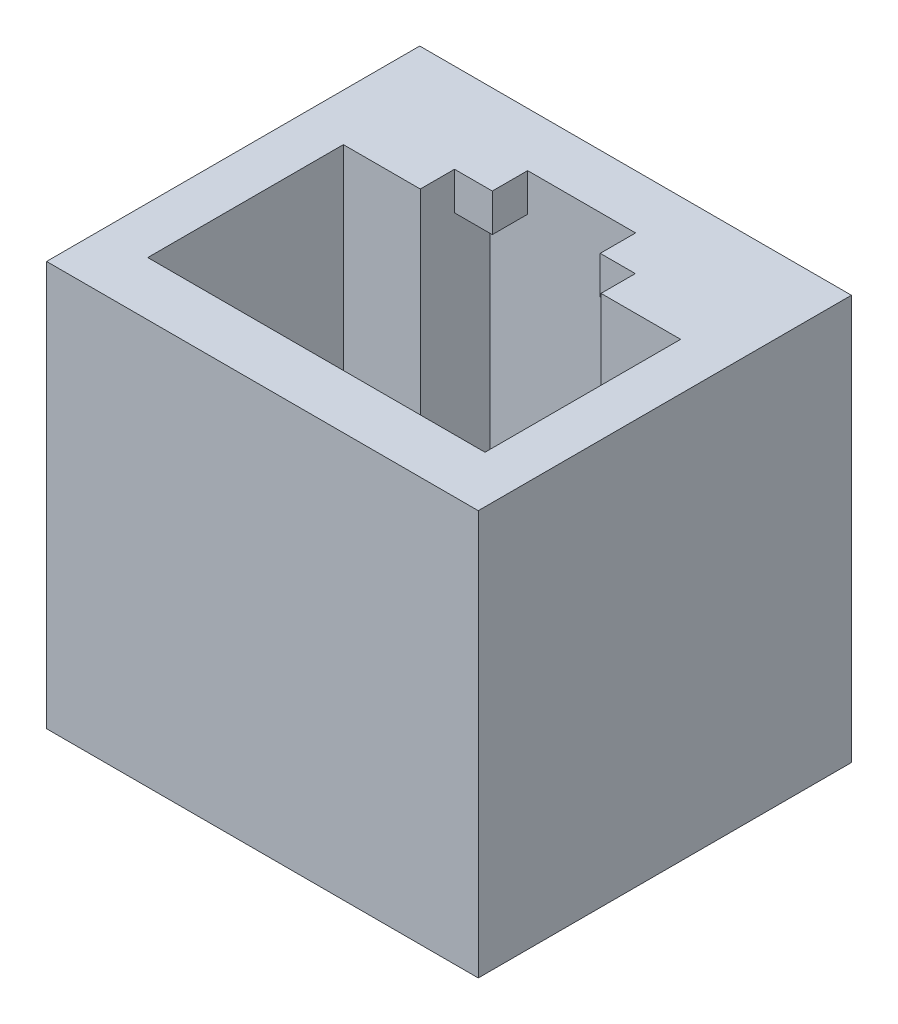
ISO-10303-21;
HEADER;
FILE_DESCRIPTION(('STEP AP214'),'2;1');
FILE_NAME('part.step','',(''),(''),'','','');
FILE_SCHEMA(('AUTOMOTIVE_DESIGN { 1 0 10303 214 1 1 1 1 }'));
ENDSEC;
DATA;
#1=APPLICATION_CONTEXT('core data for automotive mechanical design processes');
#2=APPLICATION_PROTOCOL_DEFINITION('international standard','automotive_design',2000,#1);
#3=PRODUCT_CONTEXT('',#1,'mechanical');
#4=PRODUCT('Part','Part','',(#3));
#5=PRODUCT_RELATED_PRODUCT_CATEGORY('part','',(#4));
#6=PRODUCT_DEFINITION_FORMATION('','',#4);
#7=PRODUCT_DEFINITION_CONTEXT('part definition',#1,'design');
#8=PRODUCT_DEFINITION('design','',#6,#7);
#9=PRODUCT_DEFINITION_SHAPE('','',#8);
#10=(LENGTH_UNIT() NAMED_UNIT(*) SI_UNIT(.MILLI.,.METRE.));
#11=(NAMED_UNIT(*) PLANE_ANGLE_UNIT() SI_UNIT($,.RADIAN.));
#12=(NAMED_UNIT(*) SI_UNIT($,.STERADIAN.) SOLID_ANGLE_UNIT());
#13=UNCERTAINTY_MEASURE_WITH_UNIT(LENGTH_MEASURE(1.E-05),#10,'distance_accuracy_value','');
#14=(GEOMETRIC_REPRESENTATION_CONTEXT(3) GLOBAL_UNCERTAINTY_ASSIGNED_CONTEXT((#13)) GLOBAL_UNIT_ASSIGNED_CONTEXT((#10,
#11,#12)) REPRESENTATION_CONTEXT('',''));
#15=CARTESIAN_POINT('',(0.,0.,0.));
#16=DIRECTION('',(0.,0.,1.));
#17=DIRECTION('',(1.,0.,0.));
#18=AXIS2_PLACEMENT_3D('',#15,#16,#17);
#19=CARTESIAN_POINT('',(-1.75,25.,-11.83));
#20=DIRECTION('',(1.,0.,0.));
#21=DIRECTION('',(0.,0.,-1.));
#22=AXIS2_PLACEMENT_3D('',#19,#20,#21);
#23=PLANE('',#22);
#24=DIRECTION('',(0.,0.,-1.));
#25=VECTOR('',#24,1.);
#26=CARTESIAN_POINT('',(-1.75,10.,2.));
#27=LINE('',#26,#25);
#28=CARTESIAN_POINT('',(-1.75,10.,2.));
#29=VERTEX_POINT('',#28);
#30=CARTESIAN_POINT('',(-1.75,10.,-11.83));
#31=VERTEX_POINT('',#30);
#32=EDGE_CURVE('E55',#29,#31,#27,.T.);
#33=ORIENTED_EDGE('',*,*,#32,.F.);
#34=DIRECTION('',(0.,-1.,0.));
#35=VECTOR('',#34,1.);
#36=CARTESIAN_POINT('',(-1.75,25.,2.));
#37=LINE('',#36,#35);
#38=CARTESIAN_POINT('',(-1.75,25.,2.));
#39=VERTEX_POINT('',#38);
#40=EDGE_CURVE('E48',#39,#29,#37,.T.);
#41=ORIENTED_EDGE('',*,*,#40,.F.);
#42=DIRECTION('',(0.,0.,1.));
#43=VECTOR('',#42,1.);
#44=CARTESIAN_POINT('',(-1.75,25.,-11.83));
#45=LINE('',#44,#43);
#46=CARTESIAN_POINT('',(-1.75,25.,-11.83));
#47=VERTEX_POINT('',#46);
#48=EDGE_CURVE('E233',#47,#39,#45,.T.);
#49=ORIENTED_EDGE('',*,*,#48,.F.);
#50=DIRECTION('',(0.,-1.,0.));
#51=VECTOR('',#50,1.);
#52=CARTESIAN_POINT('',(-1.75,25.,-11.83));
#53=LINE('',#52,#51);
#54=EDGE_CURVE('E220',#47,#31,#53,.T.);
#55=ORIENTED_EDGE('',*,*,#54,.T.);
#56=EDGE_LOOP('',(#33,#41,#49,#55));
#57=FACE_BOUND('',#56,.T.);
#58=ADVANCED_FACE('F41',(#57),#23,.F.);
#59=CARTESIAN_POINT('',(-1.75,25.,2.));
#60=DIRECTION('',(0.,0.,-1.));
#61=DIRECTION('',(-1.,0.,0.));
#62=AXIS2_PLACEMENT_3D('',#59,#60,#61);
#63=PLANE('',#62);
#64=DIRECTION('',(-1.,0.,0.));
#65=VECTOR('',#64,1.);
#66=CARTESIAN_POINT('',(-1.75,10.,2.));
#67=LINE('',#66,#65);
#68=CARTESIAN_POINT('',(14.25,10.,2.));
#69=VERTEX_POINT('',#68);
#70=EDGE_CURVE('E216',#69,#29,#67,.T.);
#71=ORIENTED_EDGE('',*,*,#70,.F.);
#72=DIRECTION('',(0.,-1.,0.));
#73=VECTOR('',#72,1.);
#74=CARTESIAN_POINT('',(14.25,25.,2.));
#75=LINE('',#74,#73);
#76=CARTESIAN_POINT('',(14.25,25.,2.));
#77=VERTEX_POINT('',#76);
#78=EDGE_CURVE('E215',#77,#69,#75,.T.);
#79=ORIENTED_EDGE('',*,*,#78,.F.);
#80=DIRECTION('',(1.,0.,0.));
#81=VECTOR('',#80,1.);
#82=CARTESIAN_POINT('',(-1.75,25.,2.));
#83=LINE('',#82,#81);
#84=EDGE_CURVE('E229',#39,#77,#83,.T.);
#85=ORIENTED_EDGE('',*,*,#84,.F.);
#86=ORIENTED_EDGE('',*,*,#40,.T.);
#87=EDGE_LOOP('',(#71,#79,#85,#86));
#88=FACE_BOUND('',#87,.T.);
#89=ADVANCED_FACE('F228',(#88),#63,.F.);
#90=CARTESIAN_POINT('',(14.25,25.,-11.83));
#91=DIRECTION('',(-1.,0.,0.));
#92=DIRECTION('',(0.,0.,1.));
#93=AXIS2_PLACEMENT_3D('',#90,#91,#92);
#94=PLANE('',#93);
#95=DIRECTION('',(0.,0.,1.));
#96=VECTOR('',#95,1.);
#97=CARTESIAN_POINT('',(14.25,10.,2.));
#98=LINE('',#97,#96);
#99=CARTESIAN_POINT('',(14.25,10.,-11.83));
#100=VERTEX_POINT('',#99);
#101=EDGE_CURVE('E200',#100,#69,#98,.T.);
#102=ORIENTED_EDGE('',*,*,#101,.F.);
#103=DIRECTION('',(0.,-1.,0.));
#104=VECTOR('',#103,1.);
#105=CARTESIAN_POINT('',(14.25,25.,-11.83));
#106=LINE('',#105,#104);
#107=CARTESIAN_POINT('',(14.25,25.,-11.83));
#108=VERTEX_POINT('',#107);
#109=EDGE_CURVE('E212',#108,#100,#106,.T.);
#110=ORIENTED_EDGE('',*,*,#109,.F.);
#111=DIRECTION('',(0.,0.,-1.));
#112=VECTOR('',#111,1.);
#113=CARTESIAN_POINT('',(14.25,25.,-11.83));
#114=LINE('',#113,#112);
#115=EDGE_CURVE('E393',#77,#108,#114,.T.);
#116=ORIENTED_EDGE('',*,*,#115,.F.);
#117=ORIENTED_EDGE('',*,*,#78,.T.);
#118=EDGE_LOOP('',(#102,#110,#116,#117));
#119=FACE_BOUND('',#118,.T.);
#120=ADVANCED_FACE('F210',(#119),#94,.F.);
#121=CARTESIAN_POINT('',(-1.75,25.,-11.83));
#122=DIRECTION('',(0.,0.,1.));
#123=DIRECTION('',(1.,0.,0.));
#124=AXIS2_PLACEMENT_3D('',#121,#122,#123);
#125=PLANE('',#124);
#126=DIRECTION('',(1.,0.,0.));
#127=VECTOR('',#126,1.);
#128=CARTESIAN_POINT('',(-1.75,10.,-11.83));
#129=LINE('',#128,#127);
#130=EDGE_CURVE('E197',#31,#100,#129,.T.);
#131=ORIENTED_EDGE('',*,*,#130,.F.);
#132=ORIENTED_EDGE('',*,*,#54,.F.);
#133=DIRECTION('',(-1.,0.,0.));
#134=VECTOR('',#133,1.);
#135=CARTESIAN_POINT('',(-1.75,25.,-11.83));
#136=LINE('',#135,#134);
#137=EDGE_CURVE('E219',#108,#47,#136,.T.);
#138=ORIENTED_EDGE('',*,*,#137,.F.);
#139=ORIENTED_EDGE('',*,*,#109,.T.);
#140=EDGE_LOOP('',(#131,#132,#138,#139));
#141=FACE_BOUND('',#140,.T.);
#142=ADVANCED_FACE('F218',(#141),#125,.F.);
#143=CARTESIAN_POINT('',(12.5,25.,0.));
#144=DIRECTION('',(0.,0.,-1.));
#145=DIRECTION('',(-1.,0.,0.));
#146=AXIS2_PLACEMENT_3D('',#143,#144,#145);
#147=PLANE('',#146);
#148=DIRECTION('',(0.,-1.,0.));
#149=VECTOR('',#148,1.);
#150=CARTESIAN_POINT('',(12.5,25.,0.));
#151=LINE('',#150,#149);
#152=CARTESIAN_POINT('',(12.5,25.,0.));
#153=VERTEX_POINT('',#152);
#154=CARTESIAN_POINT('',(12.5,10.,0.));
#155=VERTEX_POINT('',#154);
#156=EDGE_CURVE('E388',#153,#155,#151,.T.);
#157=ORIENTED_EDGE('',*,*,#156,.T.);
#158=DIRECTION('',(-1.,0.,0.));
#159=VECTOR('',#158,1.);
#160=CARTESIAN_POINT('',(12.5,10.,0.));
#161=LINE('',#160,#159);
#162=CARTESIAN_POINT('',(0.,10.,0.));
#163=VERTEX_POINT('',#162);
#164=EDGE_CURVE('E256',#155,#163,#161,.T.);
#165=ORIENTED_EDGE('',*,*,#164,.T.);
#166=DIRECTION('',(0.,-1.,0.));
#167=VECTOR('',#166,1.);
#168=CARTESIAN_POINT('',(0.,25.,0.));
#169=LINE('',#168,#167);
#170=CARTESIAN_POINT('',(0.,25.,0.));
#171=VERTEX_POINT('',#170);
#172=EDGE_CURVE('E355',#171,#163,#169,.T.);
#173=ORIENTED_EDGE('',*,*,#172,.F.);
#174=DIRECTION('',(1.,0.,0.));
#175=VECTOR('',#174,1.);
#176=CARTESIAN_POINT('',(12.5,25.,0.));
#177=LINE('',#176,#175);
#178=EDGE_CURVE('E330',#171,#153,#177,.T.);
#179=ORIENTED_EDGE('',*,*,#178,.T.);
#180=EDGE_LOOP('',(#157,#165,#173,#179));
#181=FACE_BOUND('',#180,.T.);
#182=ADVANCED_FACE('F425',(#181),#147,.T.);
#183=CARTESIAN_POINT('',(12.5,25.,-7.25));
#184=DIRECTION('',(-1.,0.,0.));
#185=DIRECTION('',(0.,0.,1.));
#186=AXIS2_PLACEMENT_3D('',#183,#184,#185);
#187=PLANE('',#186);
#188=DIRECTION('',(0.,-1.,0.));
#189=VECTOR('',#188,1.);
#190=CARTESIAN_POINT('',(12.5,34.9839750654128,-6.1));
#191=LINE('',#190,#189);
#192=CARTESIAN_POINT('',(12.5,16.73,-6.1));
#193=VERTEX_POINT('',#192);
#194=CARTESIAN_POINT('',(12.5,10.,-6.1));
#195=VERTEX_POINT('',#194);
#196=EDGE_CURVE('E317',#193,#195,#191,.T.);
#197=ORIENTED_EDGE('',*,*,#196,.T.);
#198=DIRECTION('',(0.,0.,1.));
#199=VECTOR('',#198,1.);
#200=CARTESIAN_POINT('',(12.5,10.,-7.25));
#201=LINE('',#200,#199);
#202=EDGE_CURVE('E265',#195,#155,#201,.T.);
#203=ORIENTED_EDGE('',*,*,#202,.T.);
#204=ORIENTED_EDGE('',*,*,#156,.F.);
#205=DIRECTION('',(0.,0.,-1.));
#206=VECTOR('',#205,1.);
#207=CARTESIAN_POINT('',(12.5,25.,-7.25));
#208=LINE('',#207,#206);
#209=CARTESIAN_POINT('',(12.5,25.,-7.25));
#210=VERTEX_POINT('',#209);
#211=EDGE_CURVE('E332',#153,#210,#208,.T.);
#212=ORIENTED_EDGE('',*,*,#211,.T.);
#213=DIRECTION('',(0.,-1.,0.));
#214=VECTOR('',#213,1.);
#215=CARTESIAN_POINT('',(12.5,25.,-7.25));
#216=LINE('',#215,#214);
#217=CARTESIAN_POINT('',(12.5,16.73,-7.25));
#218=VERTEX_POINT('',#217);
#219=EDGE_CURVE('E385',#210,#218,#216,.T.);
#220=ORIENTED_EDGE('',*,*,#219,.T.);
#221=DIRECTION('',(0.,0.,1.));
#222=VECTOR('',#221,1.);
#223=CARTESIAN_POINT('',(12.5,16.73,-7.25));
#224=LINE('',#223,#222);
#225=EDGE_CURVE('E315',#218,#193,#224,.T.);
#226=ORIENTED_EDGE('',*,*,#225,.T.);
#227=EDGE_LOOP('',(#197,#203,#204,#212,#220,#226));
#228=FACE_BOUND('',#227,.T.);
#229=ADVANCED_FACE('F409',(#228),#187,.T.);
#230=CARTESIAN_POINT('',(9.55,25.,-7.25));
#231=DIRECTION('',(0.,0.,1.));
#232=DIRECTION('',(1.,0.,0.));
#233=AXIS2_PLACEMENT_3D('',#230,#231,#232);
#234=PLANE('',#233);
#235=DIRECTION('',(0.,-1.,0.));
#236=VECTOR('',#235,1.);
#237=CARTESIAN_POINT('',(9.55,25.,-7.25));
#238=LINE('',#237,#236);
#239=CARTESIAN_POINT('',(9.55,25.,-7.25));
#240=VERTEX_POINT('',#239);
#241=CARTESIAN_POINT('',(9.55,10.,-7.25));
#242=VERTEX_POINT('',#241);
#243=EDGE_CURVE('E382',#240,#242,#238,.T.);
#244=ORIENTED_EDGE('',*,*,#243,.T.);
#245=DIRECTION('',(1.,0.,0.));
#246=VECTOR('',#245,1.);
#247=CARTESIAN_POINT('',(9.55,10.,-7.25));
#248=LINE('',#247,#246);
#249=CARTESIAN_POINT('',(11.5,10.,-7.25));
#250=VERTEX_POINT('',#249);
#251=EDGE_CURVE('E253',#242,#250,#248,.T.);
#252=ORIENTED_EDGE('',*,*,#251,.T.);
#253=DIRECTION('',(0.,-1.,0.));
#254=VECTOR('',#253,1.);
#255=CARTESIAN_POINT('',(11.5,34.9839750654128,-7.25));
#256=LINE('',#255,#254);
#257=CARTESIAN_POINT('',(11.5,16.73,-7.25));
#258=VERTEX_POINT('',#257);
#259=EDGE_CURVE('E320',#258,#250,#256,.T.);
#260=ORIENTED_EDGE('',*,*,#259,.F.);
#261=DIRECTION('',(1.,0.,0.));
#262=VECTOR('',#261,1.);
#263=CARTESIAN_POINT('',(12.5,16.73,-7.25));
#264=LINE('',#263,#262);
#265=EDGE_CURVE('E318',#258,#218,#264,.T.);
#266=ORIENTED_EDGE('',*,*,#265,.T.);
#267=ORIENTED_EDGE('',*,*,#219,.F.);
#268=DIRECTION('',(-1.,0.,0.));
#269=VECTOR('',#268,1.);
#270=CARTESIAN_POINT('',(9.55,25.,-7.25));
#271=LINE('',#270,#269);
#272=EDGE_CURVE('E334',#210,#240,#271,.T.);
#273=ORIENTED_EDGE('',*,*,#272,.T.);
#274=EDGE_LOOP('',(#244,#252,#260,#266,#267,#273));
#275=FACE_BOUND('',#274,.T.);
#276=ADVANCED_FACE('F412',(#275),#234,.T.);
#277=CARTESIAN_POINT('',(9.55,25.,-8.52));
#278=DIRECTION('',(-1.,0.,0.));
#279=DIRECTION('',(0.,0.,1.));
#280=AXIS2_PLACEMENT_3D('',#277,#278,#279);
#281=PLANE('',#280);
#282=DIRECTION('',(0.,-1.,0.));
#283=VECTOR('',#282,1.);
#284=CARTESIAN_POINT('',(9.55,23.6,-9.83));
#285=LINE('',#284,#283);
#286=CARTESIAN_POINT('',(9.55,23.6,-9.83));
#287=VERTEX_POINT('',#286);
#288=CARTESIAN_POINT('',(9.55,10.,-9.83));
#289=VERTEX_POINT('',#288);
#290=EDGE_CURVE('E268',#287,#289,#285,.T.);
#291=ORIENTED_EDGE('',*,*,#290,.T.);
#292=DIRECTION('',(0.,0.,1.));
#293=VECTOR('',#292,1.);
#294=CARTESIAN_POINT('',(9.55,10.,-8.52));
#295=LINE('',#294,#293);
#296=EDGE_CURVE('E250',#289,#242,#295,.T.);
#297=ORIENTED_EDGE('',*,*,#296,.T.);
#298=ORIENTED_EDGE('',*,*,#243,.F.);
#299=DIRECTION('',(0.,0.,-1.));
#300=VECTOR('',#299,1.);
#301=CARTESIAN_POINT('',(9.55,25.,-8.52));
#302=LINE('',#301,#300);
#303=CARTESIAN_POINT('',(9.55,25.,-8.52));
#304=VERTEX_POINT('',#303);
#305=EDGE_CURVE('E336',#240,#304,#302,.T.);
#306=ORIENTED_EDGE('',*,*,#305,.T.);
#307=DIRECTION('',(0.,-1.,0.));
#308=VECTOR('',#307,1.);
#309=CARTESIAN_POINT('',(9.55,25.,-8.52));
#310=LINE('',#309,#308);
#311=CARTESIAN_POINT('',(9.55,23.6,-8.52));
#312=VERTEX_POINT('',#311);
#313=EDGE_CURVE('E379',#304,#312,#310,.T.);
#314=ORIENTED_EDGE('',*,*,#313,.T.);
#315=DIRECTION('',(0.,0.,1.));
#316=VECTOR('',#315,1.);
#317=CARTESIAN_POINT('',(9.55,23.6,-8.52));
#318=LINE('',#317,#316);
#319=EDGE_CURVE('E287',#287,#312,#318,.T.);
#320=ORIENTED_EDGE('',*,*,#319,.F.);
#321=EDGE_LOOP('',(#291,#297,#298,#306,#314,#320));
#322=FACE_BOUND('',#321,.T.);
#323=ADVANCED_FACE('F465',(#322),#281,.T.);
#324=CARTESIAN_POINT('',(4.25,25.,-9.83));
#325=DIRECTION('',(0.,0.,1.));
#326=DIRECTION('',(1.,0.,0.));
#327=AXIS2_PLACEMENT_3D('',#324,#325,#326);
#328=PLANE('',#327);
#329=DIRECTION('',(0.,-1.,0.));
#330=VECTOR('',#329,1.);
#331=CARTESIAN_POINT('',(2.85,23.6,-9.83));
#332=LINE('',#331,#330);
#333=CARTESIAN_POINT('',(2.85,23.6,-9.83));
#334=VERTEX_POINT('',#333);
#335=CARTESIAN_POINT('',(2.85,10.,-9.83));
#336=VERTEX_POINT('',#335);
#337=EDGE_CURVE('E279',#334,#336,#332,.T.);
#338=ORIENTED_EDGE('',*,*,#337,.T.);
#339=DIRECTION('',(1.,0.,0.));
#340=VECTOR('',#339,1.);
#341=CARTESIAN_POINT('',(4.25,10.,-9.83));
#342=LINE('',#341,#340);
#343=EDGE_CURVE('E247',#336,#289,#342,.T.);
#344=ORIENTED_EDGE('',*,*,#343,.T.);
#345=ORIENTED_EDGE('',*,*,#290,.F.);
#346=DIRECTION('',(1.,0.,0.));
#347=VECTOR('',#346,1.);
#348=CARTESIAN_POINT('',(8.25,23.6,-9.83));
#349=LINE('',#348,#347);
#350=CARTESIAN_POINT('',(8.25,23.6,-9.83));
#351=VERTEX_POINT('',#350);
#352=EDGE_CURVE('E289',#351,#287,#349,.T.);
#353=ORIENTED_EDGE('',*,*,#352,.F.);
#354=DIRECTION('',(0.,-1.,0.));
#355=VECTOR('',#354,1.);
#356=CARTESIAN_POINT('',(8.25,25.,-9.83));
#357=LINE('',#356,#355);
#358=CARTESIAN_POINT('',(8.25,25.,-9.83));
#359=VERTEX_POINT('',#358);
#360=EDGE_CURVE('E373',#359,#351,#357,.T.);
#361=ORIENTED_EDGE('',*,*,#360,.F.);
#362=DIRECTION('',(-1.,0.,0.));
#363=VECTOR('',#362,1.);
#364=CARTESIAN_POINT('',(4.25,25.,-9.83));
#365=LINE('',#364,#363);
#366=CARTESIAN_POINT('',(4.25,25.,-9.83));
#367=VERTEX_POINT('',#366);
#368=EDGE_CURVE('E342',#359,#367,#365,.T.);
#369=ORIENTED_EDGE('',*,*,#368,.T.);
#370=DIRECTION('',(0.,-1.,0.));
#371=VECTOR('',#370,1.);
#372=CARTESIAN_POINT('',(4.25,25.,-9.83));
#373=LINE('',#372,#371);
#374=CARTESIAN_POINT('',(4.25,23.6,-9.83));
#375=VERTEX_POINT('',#374);
#376=EDGE_CURVE('E370',#367,#375,#373,.T.);
#377=ORIENTED_EDGE('',*,*,#376,.T.);
#378=DIRECTION('',(1.,0.,0.));
#379=VECTOR('',#378,1.);
#380=CARTESIAN_POINT('',(4.25,23.6,-9.83));
#381=LINE('',#380,#379);
#382=EDGE_CURVE('E277',#334,#375,#381,.T.);
#383=ORIENTED_EDGE('',*,*,#382,.F.);
#384=EDGE_LOOP('',(#338,#344,#345,#353,#361,#369,#377,#383));
#385=FACE_BOUND('',#384,.T.);
#386=ADVANCED_FACE('F452',(#385),#328,.T.);
#387=CARTESIAN_POINT('',(2.85,25.,-7.25));
#388=DIRECTION('',(1.,0.,0.));
#389=DIRECTION('',(0.,0.,-1.));
#390=AXIS2_PLACEMENT_3D('',#387,#388,#389);
#391=PLANE('',#390);
#392=DIRECTION('',(0.,-1.,0.));
#393=VECTOR('',#392,1.);
#394=CARTESIAN_POINT('',(2.85,25.,-7.25));
#395=LINE('',#394,#393);
#396=CARTESIAN_POINT('',(2.85,25.,-7.25));
#397=VERTEX_POINT('',#396);
#398=CARTESIAN_POINT('',(2.85,10.,-7.25));
#399=VERTEX_POINT('',#398);
#400=EDGE_CURVE('E361',#397,#399,#395,.T.);
#401=ORIENTED_EDGE('',*,*,#400,.T.);
#402=DIRECTION('',(0.,0.,-1.));
#403=VECTOR('',#402,1.);
#404=CARTESIAN_POINT('',(2.85,10.,-7.25));
#405=LINE('',#404,#403);
#406=EDGE_CURVE('E244',#399,#336,#405,.T.);
#407=ORIENTED_EDGE('',*,*,#406,.T.);
#408=ORIENTED_EDGE('',*,*,#337,.F.);
#409=DIRECTION('',(0.,0.,-1.));
#410=VECTOR('',#409,1.);
#411=CARTESIAN_POINT('',(2.85,23.6,-8.52));
#412=LINE('',#411,#410);
#413=CARTESIAN_POINT('',(2.85,23.6,-8.52));
#414=VERTEX_POINT('',#413);
#415=EDGE_CURVE('E274',#414,#334,#412,.T.);
#416=ORIENTED_EDGE('',*,*,#415,.F.);
#417=DIRECTION('',(0.,-1.,0.));
#418=VECTOR('',#417,1.);
#419=CARTESIAN_POINT('',(2.85,25.,-8.52));
#420=LINE('',#419,#418);
#421=CARTESIAN_POINT('',(2.85,25.,-8.52));
#422=VERTEX_POINT('',#421);
#423=EDGE_CURVE('E364',#422,#414,#420,.T.);
#424=ORIENTED_EDGE('',*,*,#423,.F.);
#425=DIRECTION('',(0.,0.,1.));
#426=VECTOR('',#425,1.);
#427=CARTESIAN_POINT('',(2.85,25.,-7.25));
#428=LINE('',#427,#426);
#429=EDGE_CURVE('E348',#422,#397,#428,.T.);
#430=ORIENTED_EDGE('',*,*,#429,.T.);
#431=EDGE_LOOP('',(#401,#407,#408,#416,#424,#430));
#432=FACE_BOUND('',#431,.T.);
#433=ADVANCED_FACE('F437',(#432),#391,.T.);
#434=CARTESIAN_POINT('',(0.,25.,-7.25));
#435=DIRECTION('',(0.,0.,1.));
#436=DIRECTION('',(1.,0.,0.));
#437=AXIS2_PLACEMENT_3D('',#434,#435,#436);
#438=PLANE('',#437);
#439=DIRECTION('',(0.,-1.,0.));
#440=VECTOR('',#439,1.);
#441=CARTESIAN_POINT('',(1.,34.9839750654128,-7.25));
#442=LINE('',#441,#440);
#443=CARTESIAN_POINT('',(1.,16.73,-7.25));
#444=VERTEX_POINT('',#443);
#445=CARTESIAN_POINT('',(1.,10.,-7.25));
#446=VERTEX_POINT('',#445);
#447=EDGE_CURVE('E293',#444,#446,#442,.T.);
#448=ORIENTED_EDGE('',*,*,#447,.T.);
#449=DIRECTION('',(1.,0.,0.));
#450=VECTOR('',#449,1.);
#451=CARTESIAN_POINT('',(0.,10.,-7.25));
#452=LINE('',#451,#450);
#453=EDGE_CURVE('E241',#446,#399,#452,.T.);
#454=ORIENTED_EDGE('',*,*,#453,.T.);
#455=ORIENTED_EDGE('',*,*,#400,.F.);
#456=DIRECTION('',(-1.,0.,0.));
#457=VECTOR('',#456,1.);
#458=CARTESIAN_POINT('',(0.,25.,-7.25));
#459=LINE('',#458,#457);
#460=CARTESIAN_POINT('',(0.,25.,-7.25));
#461=VERTEX_POINT('',#460);
#462=EDGE_CURVE('E350',#397,#461,#459,.T.);
#463=ORIENTED_EDGE('',*,*,#462,.T.);
#464=DIRECTION('',(0.,-1.,0.));
#465=VECTOR('',#464,1.);
#466=CARTESIAN_POINT('',(0.,25.,-7.25));
#467=LINE('',#466,#465);
#468=CARTESIAN_POINT('',(0.,16.73,-7.25));
#469=VERTEX_POINT('',#468);
#470=EDGE_CURVE('E358',#461,#469,#467,.T.);
#471=ORIENTED_EDGE('',*,*,#470,.T.);
#472=DIRECTION('',(1.,0.,0.));
#473=VECTOR('',#472,1.);
#474=CARTESIAN_POINT('',(0.,16.73,-7.25));
#475=LINE('',#474,#473);
#476=EDGE_CURVE('E296',#469,#444,#475,.T.);
#477=ORIENTED_EDGE('',*,*,#476,.T.);
#478=EDGE_LOOP('',(#448,#454,#455,#463,#471,#477));
#479=FACE_BOUND('',#478,.T.);
#480=ADVANCED_FACE('F434',(#479),#438,.T.);
#481=CARTESIAN_POINT('',(0.,25.,0.));
#482=DIRECTION('',(1.,0.,0.));
#483=DIRECTION('',(0.,0.,-1.));
#484=AXIS2_PLACEMENT_3D('',#481,#482,#483);
#485=PLANE('',#484);
#486=ORIENTED_EDGE('',*,*,#172,.T.);
#487=DIRECTION('',(0.,0.,-1.));
#488=VECTOR('',#487,1.);
#489=CARTESIAN_POINT('',(0.,10.,0.));
#490=LINE('',#489,#488);
#491=CARTESIAN_POINT('',(0.,10.,-6.1));
#492=VERTEX_POINT('',#491);
#493=EDGE_CURVE('E238',#163,#492,#490,.T.);
#494=ORIENTED_EDGE('',*,*,#493,.T.);
#495=DIRECTION('',(0.,-1.,0.));
#496=VECTOR('',#495,1.);
#497=CARTESIAN_POINT('',(0.,34.9839750654128,-6.1));
#498=LINE('',#497,#496);
#499=CARTESIAN_POINT('',(0.,16.73,-6.1));
#500=VERTEX_POINT('',#499);
#501=EDGE_CURVE('E302',#500,#492,#498,.T.);
#502=ORIENTED_EDGE('',*,*,#501,.F.);
#503=DIRECTION('',(0.,0.,-1.));
#504=VECTOR('',#503,1.);
#505=CARTESIAN_POINT('',(0.,16.73,-7.25));
#506=LINE('',#505,#504);
#507=EDGE_CURVE('E282',#500,#469,#506,.T.);
#508=ORIENTED_EDGE('',*,*,#507,.T.);
#509=ORIENTED_EDGE('',*,*,#470,.F.);
#510=DIRECTION('',(0.,0.,1.));
#511=VECTOR('',#510,1.);
#512=CARTESIAN_POINT('',(0.,25.,0.));
#513=LINE('',#512,#511);
#514=EDGE_CURVE('E353',#461,#171,#513,.T.);
#515=ORIENTED_EDGE('',*,*,#514,.T.);
#516=EDGE_LOOP('',(#486,#494,#502,#508,#509,#515));
#517=FACE_BOUND('',#516,.T.);
#518=ADVANCED_FACE('F428',(#517),#485,.T.);
#519=CARTESIAN_POINT('',(12.5,34.9839750654128,-6.1));
#520=DIRECTION('',(0.,0.,1.));
#521=DIRECTION('',(1.,0.,0.));
#522=AXIS2_PLACEMENT_3D('',#519,#520,#521);
#523=PLANE('',#522);
#524=DIRECTION('',(0.,-1.,0.));
#525=VECTOR('',#524,1.);
#526=CARTESIAN_POINT('',(11.5,34.9839750654128,-6.1));
#527=LINE('',#526,#525);
#528=CARTESIAN_POINT('',(11.5,16.73,-6.1));
#529=VERTEX_POINT('',#528);
#530=CARTESIAN_POINT('',(11.5,10.,-6.1));
#531=VERTEX_POINT('',#530);
#532=EDGE_CURVE('E314',#529,#531,#527,.T.);
#533=ORIENTED_EDGE('',*,*,#532,.T.);
#534=DIRECTION('',(1.,0.,0.));
#535=VECTOR('',#534,1.);
#536=CARTESIAN_POINT('',(12.5,10.,-6.1));
#537=LINE('',#536,#535);
#538=EDGE_CURVE('E262',#531,#195,#537,.T.);
#539=ORIENTED_EDGE('',*,*,#538,.T.);
#540=ORIENTED_EDGE('',*,*,#196,.F.);
#541=DIRECTION('',(-1.,0.,0.));
#542=VECTOR('',#541,1.);
#543=CARTESIAN_POINT('',(12.5,16.73,-6.1));
#544=LINE('',#543,#542);
#545=EDGE_CURVE('E311',#193,#529,#544,.T.);
#546=ORIENTED_EDGE('',*,*,#545,.T.);
#547=EDGE_LOOP('',(#533,#539,#540,#546));
#548=FACE_BOUND('',#547,.T.);
#549=ADVANCED_FACE('F423',(#548),#523,.T.);
#550=CARTESIAN_POINT('',(11.5,34.9839750654128,-7.25));
#551=DIRECTION('',(-1.,0.,0.));
#552=DIRECTION('',(0.,0.,1.));
#553=AXIS2_PLACEMENT_3D('',#550,#551,#552);
#554=PLANE('',#553);
#555=ORIENTED_EDGE('',*,*,#259,.T.);
#556=DIRECTION('',(0.,0.,1.));
#557=VECTOR('',#556,1.);
#558=CARTESIAN_POINT('',(11.5,10.,-7.25));
#559=LINE('',#558,#557);
#560=EDGE_CURVE('E259',#250,#531,#559,.T.);
#561=ORIENTED_EDGE('',*,*,#560,.T.);
#562=ORIENTED_EDGE('',*,*,#532,.F.);
#563=DIRECTION('',(0.,0.,-1.));
#564=VECTOR('',#563,1.);
#565=CARTESIAN_POINT('',(11.5,16.73,-7.25));
#566=LINE('',#565,#564);
#567=EDGE_CURVE('E321',#529,#258,#566,.T.);
#568=ORIENTED_EDGE('',*,*,#567,.T.);
#569=EDGE_LOOP('',(#555,#561,#562,#568));
#570=FACE_BOUND('',#569,.T.);
#571=ADVANCED_FACE('F420',(#570),#554,.T.);
#572=CARTESIAN_POINT('',(1.,34.9839750654128,-7.25));
#573=DIRECTION('',(1.,0.,0.));
#574=DIRECTION('',(0.,0.,-1.));
#575=AXIS2_PLACEMENT_3D('',#572,#573,#574);
#576=PLANE('',#575);
#577=DIRECTION('',(0.,-1.,0.));
#578=VECTOR('',#577,1.);
#579=CARTESIAN_POINT('',(1.,34.9839750654128,-6.1));
#580=LINE('',#579,#578);
#581=CARTESIAN_POINT('',(1.,16.73,-6.1));
#582=VERTEX_POINT('',#581);
#583=CARTESIAN_POINT('',(1.,10.,-6.1));
#584=VERTEX_POINT('',#583);
#585=EDGE_CURVE('E298',#582,#584,#580,.T.);
#586=ORIENTED_EDGE('',*,*,#585,.T.);
#587=DIRECTION('',(0.,0.,-1.));
#588=VECTOR('',#587,1.);
#589=CARTESIAN_POINT('',(1.,10.,-7.25));
#590=LINE('',#589,#588);
#591=EDGE_CURVE('E63',#584,#446,#590,.T.);
#592=ORIENTED_EDGE('',*,*,#591,.T.);
#593=ORIENTED_EDGE('',*,*,#447,.F.);
#594=DIRECTION('',(0.,0.,1.));
#595=VECTOR('',#594,1.);
#596=CARTESIAN_POINT('',(1.,16.73,-7.25));
#597=LINE('',#596,#595);
#598=EDGE_CURVE('E297',#444,#582,#597,.T.);
#599=ORIENTED_EDGE('',*,*,#598,.T.);
#600=EDGE_LOOP('',(#586,#592,#593,#599));
#601=FACE_BOUND('',#600,.T.);
#602=ADVANCED_FACE('F523',(#601),#576,.T.);
#603=CARTESIAN_POINT('',(0.,34.9839750654128,-6.1));
#604=DIRECTION('',(0.,0.,1.));
#605=DIRECTION('',(1.,0.,0.));
#606=AXIS2_PLACEMENT_3D('',#603,#604,#605);
#607=PLANE('',#606);
#608=ORIENTED_EDGE('',*,*,#501,.T.);
#609=DIRECTION('',(1.,0.,0.));
#610=VECTOR('',#609,1.);
#611=CARTESIAN_POINT('',(0.,10.,-6.1));
#612=LINE('',#611,#610);
#613=EDGE_CURVE('E12',#492,#584,#612,.T.);
#614=ORIENTED_EDGE('',*,*,#613,.T.);
#615=ORIENTED_EDGE('',*,*,#585,.F.);
#616=DIRECTION('',(-1.,0.,0.));
#617=VECTOR('',#616,1.);
#618=CARTESIAN_POINT('',(0.,16.73,-6.1));
#619=LINE('',#618,#617);
#620=EDGE_CURVE('E301',#582,#500,#619,.T.);
#621=ORIENTED_EDGE('',*,*,#620,.T.);
#622=EDGE_LOOP('',(#608,#614,#615,#621));
#623=FACE_BOUND('',#622,.T.);
#624=ADVANCED_FACE('F503',(#623),#607,.T.);
#625=CARTESIAN_POINT('',(8.25,25.,-8.52));
#626=DIRECTION('',(0.,0.,1.));
#627=DIRECTION('',(1.,0.,0.));
#628=AXIS2_PLACEMENT_3D('',#625,#626,#627);
#629=PLANE('',#628);
#630=DIRECTION('',(0.,-1.,0.));
#631=VECTOR('',#630,1.);
#632=CARTESIAN_POINT('',(8.25,25.,-8.52));
#633=LINE('',#632,#631);
#634=CARTESIAN_POINT('',(8.25,25.,-8.52));
#635=VERTEX_POINT('',#634);
#636=CARTESIAN_POINT('',(8.25,23.6,-8.52));
#637=VERTEX_POINT('',#636);
#638=EDGE_CURVE('E376',#635,#637,#633,.T.);
#639=ORIENTED_EDGE('',*,*,#638,.T.);
#640=DIRECTION('',(-1.,0.,0.));
#641=VECTOR('',#640,1.);
#642=CARTESIAN_POINT('',(8.25,23.6,-8.52));
#643=LINE('',#642,#641);
#644=EDGE_CURVE('E285',#312,#637,#643,.T.);
#645=ORIENTED_EDGE('',*,*,#644,.F.);
#646=ORIENTED_EDGE('',*,*,#313,.F.);
#647=DIRECTION('',(-1.,0.,0.));
#648=VECTOR('',#647,1.);
#649=CARTESIAN_POINT('',(8.25,25.,-8.52));
#650=LINE('',#649,#648);
#651=EDGE_CURVE('E338',#304,#635,#650,.T.);
#652=ORIENTED_EDGE('',*,*,#651,.T.);
#653=EDGE_LOOP('',(#639,#645,#646,#652));
#654=FACE_BOUND('',#653,.T.);
#655=ADVANCED_FACE('F461',(#654),#629,.T.);
#656=CARTESIAN_POINT('',(8.25,25.,-9.83));
#657=DIRECTION('',(-1.,0.,0.));
#658=DIRECTION('',(0.,0.,1.));
#659=AXIS2_PLACEMENT_3D('',#656,#657,#658);
#660=PLANE('',#659);
#661=ORIENTED_EDGE('',*,*,#360,.T.);
#662=DIRECTION('',(0.,0.,-1.));
#663=VECTOR('',#662,1.);
#664=CARTESIAN_POINT('',(8.25,23.6,-8.52));
#665=LINE('',#664,#663);
#666=EDGE_CURVE('E272',#637,#351,#665,.T.);
#667=ORIENTED_EDGE('',*,*,#666,.F.);
#668=ORIENTED_EDGE('',*,*,#638,.F.);
#669=DIRECTION('',(0.,0.,-1.));
#670=VECTOR('',#669,1.);
#671=CARTESIAN_POINT('',(8.25,25.,-9.83));
#672=LINE('',#671,#670);
#673=EDGE_CURVE('E340',#635,#359,#672,.T.);
#674=ORIENTED_EDGE('',*,*,#673,.T.);
#675=EDGE_LOOP('',(#661,#667,#668,#674));
#676=FACE_BOUND('',#675,.T.);
#677=ADVANCED_FACE('F399',(#676),#660,.T.);
#678=CARTESIAN_POINT('',(0.,25.,0.));
#679=DIRECTION('',(0.,1.,0.));
#680=DIRECTION('',(0.,0.,1.));
#681=AXIS2_PLACEMENT_3D('',#678,#679,#680);
#682=PLANE('',#681);
#683=ORIENTED_EDGE('',*,*,#48,.T.);
#684=ORIENTED_EDGE('',*,*,#84,.T.);
#685=ORIENTED_EDGE('',*,*,#115,.T.);
#686=ORIENTED_EDGE('',*,*,#137,.T.);
#687=EDGE_LOOP('',(#683,#684,#685,#686));
#688=FACE_BOUND('',#687,.T.);
#689=ORIENTED_EDGE('',*,*,#211,.F.);
#690=ORIENTED_EDGE('',*,*,#178,.F.);
#691=ORIENTED_EDGE('',*,*,#514,.F.);
#692=ORIENTED_EDGE('',*,*,#462,.F.);
#693=ORIENTED_EDGE('',*,*,#429,.F.);
#694=DIRECTION('',(-1.,0.,0.));
#695=VECTOR('',#694,1.);
#696=CARTESIAN_POINT('',(2.85,25.,-8.52));
#697=LINE('',#696,#695);
#698=CARTESIAN_POINT('',(4.25,25.,-8.52));
#699=VERTEX_POINT('',#698);
#700=EDGE_CURVE('E346',#699,#422,#697,.T.);
#701=ORIENTED_EDGE('',*,*,#700,.F.);
#702=DIRECTION('',(0.,0.,1.));
#703=VECTOR('',#702,1.);
#704=CARTESIAN_POINT('',(4.25,25.,-8.52));
#705=LINE('',#704,#703);
#706=EDGE_CURVE('E344',#367,#699,#705,.T.);
#707=ORIENTED_EDGE('',*,*,#706,.F.);
#708=ORIENTED_EDGE('',*,*,#368,.F.);
#709=ORIENTED_EDGE('',*,*,#673,.F.);
#710=ORIENTED_EDGE('',*,*,#651,.F.);
#711=ORIENTED_EDGE('',*,*,#305,.F.);
#712=ORIENTED_EDGE('',*,*,#272,.F.);
#713=EDGE_LOOP('',(#689,#690,#691,#692,#693,#701,#707,#708,#709,#710,#711,#712));
#714=FACE_BOUND('',#713,.T.);
#715=ADVANCED_FACE('F395',(#688,#714),#682,.T.);
#716=CARTESIAN_POINT('',(4.25,25.,-8.52));
#717=DIRECTION('',(1.,0.,0.));
#718=DIRECTION('',(0.,0.,-1.));
#719=AXIS2_PLACEMENT_3D('',#716,#717,#718);
#720=PLANE('',#719);
#721=DIRECTION('',(0.,0.,1.));
#722=VECTOR('',#721,1.);
#723=CARTESIAN_POINT('',(4.25,23.6,-8.52));
#724=LINE('',#723,#722);
#725=CARTESIAN_POINT('',(4.25,23.6,-8.52));
#726=VERTEX_POINT('',#725);
#727=EDGE_CURVE('E269',#375,#726,#724,.T.);
#728=ORIENTED_EDGE('',*,*,#727,.F.);
#729=ORIENTED_EDGE('',*,*,#376,.F.);
#730=ORIENTED_EDGE('',*,*,#706,.T.);
#731=DIRECTION('',(0.,-1.,0.));
#732=VECTOR('',#731,1.);
#733=CARTESIAN_POINT('',(4.25,25.,-8.52));
#734=LINE('',#733,#732);
#735=EDGE_CURVE('E367',#699,#726,#734,.T.);
#736=ORIENTED_EDGE('',*,*,#735,.T.);
#737=EDGE_LOOP('',(#728,#729,#730,#736));
#738=FACE_BOUND('',#737,.T.);
#739=ADVANCED_FACE('F398',(#738),#720,.T.);
#740=CARTESIAN_POINT('',(2.85,25.,-8.52));
#741=DIRECTION('',(0.,0.,1.));
#742=DIRECTION('',(1.,0.,0.));
#743=AXIS2_PLACEMENT_3D('',#740,#741,#742);
#744=PLANE('',#743);
#745=DIRECTION('',(-1.,0.,0.));
#746=VECTOR('',#745,1.);
#747=CARTESIAN_POINT('',(4.25,23.6,-8.52));
#748=LINE('',#747,#746);
#749=EDGE_CURVE('E271',#726,#414,#748,.T.);
#750=ORIENTED_EDGE('',*,*,#749,.F.);
#751=ORIENTED_EDGE('',*,*,#735,.F.);
#752=ORIENTED_EDGE('',*,*,#700,.T.);
#753=ORIENTED_EDGE('',*,*,#423,.T.);
#754=EDGE_LOOP('',(#750,#751,#752,#753));
#755=FACE_BOUND('',#754,.T.);
#756=ADVANCED_FACE('F442',(#755),#744,.T.);
#757=CARTESIAN_POINT('',(0.,16.73,0.));
#758=DIRECTION('',(0.,1.,0.));
#759=DIRECTION('',(0.,0.,1.));
#760=AXIS2_PLACEMENT_3D('',#757,#758,#759);
#761=PLANE('',#760);
#762=ORIENTED_EDGE('',*,*,#225,.F.);
#763=ORIENTED_EDGE('',*,*,#265,.F.);
#764=ORIENTED_EDGE('',*,*,#567,.F.);
#765=ORIENTED_EDGE('',*,*,#545,.F.);
#766=EDGE_LOOP('',(#762,#763,#764,#765));
#767=FACE_BOUND('',#766,.T.);
#768=ADVANCED_FACE('F416',(#767),#761,.T.);
#769=CARTESIAN_POINT('',(0.,16.73,0.));
#770=DIRECTION('',(0.,1.,0.));
#771=DIRECTION('',(0.,0.,1.));
#772=AXIS2_PLACEMENT_3D('',#769,#770,#771);
#773=PLANE('',#772);
#774=ORIENTED_EDGE('',*,*,#507,.F.);
#775=ORIENTED_EDGE('',*,*,#620,.F.);
#776=ORIENTED_EDGE('',*,*,#598,.F.);
#777=ORIENTED_EDGE('',*,*,#476,.F.);
#778=EDGE_LOOP('',(#774,#775,#776,#777));
#779=FACE_BOUND('',#778,.T.);
#780=ADVANCED_FACE('F470',(#779),#773,.T.);
#781=CARTESIAN_POINT('',(0.,23.6,0.));
#782=DIRECTION('',(0.,1.,0.));
#783=DIRECTION('',(0.,0.,1.));
#784=AXIS2_PLACEMENT_3D('',#781,#782,#783);
#785=PLANE('',#784);
#786=ORIENTED_EDGE('',*,*,#727,.T.);
#787=ORIENTED_EDGE('',*,*,#749,.T.);
#788=ORIENTED_EDGE('',*,*,#415,.T.);
#789=ORIENTED_EDGE('',*,*,#382,.T.);
#790=EDGE_LOOP('',(#786,#787,#788,#789));
#791=FACE_BOUND('',#790,.T.);
#792=ADVANCED_FACE('F467',(#791),#785,.F.);
#793=CARTESIAN_POINT('',(0.,23.6,0.));
#794=DIRECTION('',(0.,-1.,0.));
#795=DIRECTION('',(0.,0.,-1.));
#796=AXIS2_PLACEMENT_3D('',#793,#794,#795);
#797=PLANE('',#796);
#798=ORIENTED_EDGE('',*,*,#666,.T.);
#799=ORIENTED_EDGE('',*,*,#352,.T.);
#800=ORIENTED_EDGE('',*,*,#319,.T.);
#801=ORIENTED_EDGE('',*,*,#644,.T.);
#802=EDGE_LOOP('',(#798,#799,#800,#801));
#803=FACE_BOUND('',#802,.T.);
#804=ADVANCED_FACE('F469',(#803),#797,.T.);
#805=CARTESIAN_POINT('',(0.,10.,0.));
#806=DIRECTION('',(0.,-1.,0.));
#807=DIRECTION('',(0.,0.,-1.));
#808=AXIS2_PLACEMENT_3D('',#805,#806,#807);
#809=PLANE('',#808);
#810=ORIENTED_EDGE('',*,*,#538,.F.);
#811=ORIENTED_EDGE('',*,*,#560,.F.);
#812=ORIENTED_EDGE('',*,*,#251,.F.);
#813=ORIENTED_EDGE('',*,*,#296,.F.);
#814=ORIENTED_EDGE('',*,*,#343,.F.);
#815=ORIENTED_EDGE('',*,*,#406,.F.);
#816=ORIENTED_EDGE('',*,*,#453,.F.);
#817=ORIENTED_EDGE('',*,*,#591,.F.);
#818=ORIENTED_EDGE('',*,*,#613,.F.);
#819=ORIENTED_EDGE('',*,*,#493,.F.);
#820=ORIENTED_EDGE('',*,*,#164,.F.);
#821=ORIENTED_EDGE('',*,*,#202,.F.);
#822=EDGE_LOOP('',(#810,#811,#812,#813,#814,#815,#816,#817,#818,#819,#820,#821));
#823=FACE_BOUND('',#822,.T.);
#824=ORIENTED_EDGE('',*,*,#32,.T.);
#825=ORIENTED_EDGE('',*,*,#130,.T.);
#826=ORIENTED_EDGE('',*,*,#101,.T.);
#827=ORIENTED_EDGE('',*,*,#70,.T.);
#828=EDGE_LOOP('',(#824,#825,#826,#827));
#829=FACE_BOUND('',#828,.T.);
#830=ADVANCED_FACE('F199',(#823,#829),#809,.T.);
#831=CLOSED_SHELL('',(#58,#89,#120,#142,#182,#229,#276,#323,#386,#433,#480,#518,#549,#571,#602,
#624,#655,#677,#715,#739,#756,#768,#780,#792,#804,#830));
#832=MANIFOLD_SOLID_BREP('B2',#831);
#833=ADVANCED_BREP_SHAPE_REPRESENTATION('',(#18,#832),#14);
#834=SHAPE_DEFINITION_REPRESENTATION(#9,#833);
ENDSEC;
END-ISO-10303-21;
